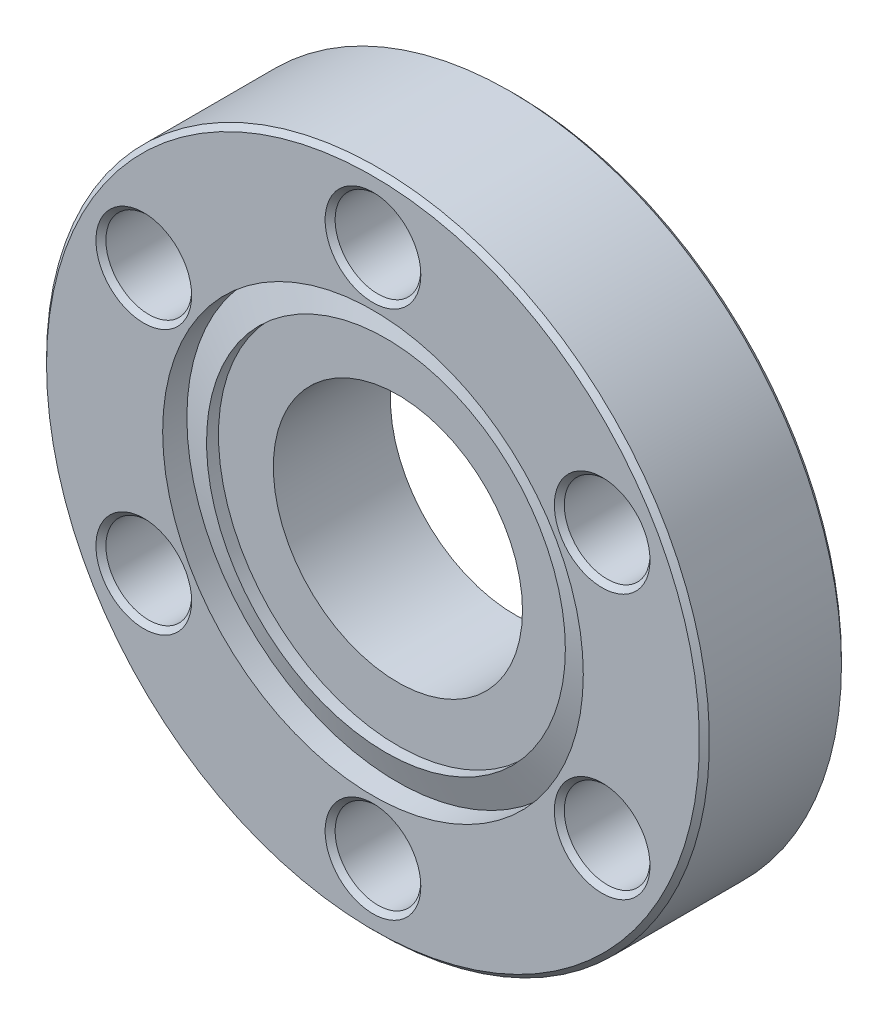
ISO-10303-21;
HEADER;
FILE_DESCRIPTION(('STEP AP214'),'2;1');
FILE_NAME('part.step','',(''),(''),'','','');
FILE_SCHEMA(('AUTOMOTIVE_DESIGN { 1 0 10303 214 1 1 1 1 }'));
ENDSEC;
DATA;
#1=APPLICATION_CONTEXT('core data for automotive mechanical design processes');
#2=APPLICATION_PROTOCOL_DEFINITION('international standard','automotive_design',2000,#1);
#3=PRODUCT_CONTEXT('',#1,'mechanical');
#4=PRODUCT('Part','Part','',(#3));
#5=PRODUCT_RELATED_PRODUCT_CATEGORY('part','',(#4));
#6=PRODUCT_DEFINITION_FORMATION('','',#4);
#7=PRODUCT_DEFINITION_CONTEXT('part definition',#1,'design');
#8=PRODUCT_DEFINITION('design','',#6,#7);
#9=PRODUCT_DEFINITION_SHAPE('','',#8);
#10=(LENGTH_UNIT() NAMED_UNIT(*) SI_UNIT(.MILLI.,.METRE.));
#11=(NAMED_UNIT(*) PLANE_ANGLE_UNIT() SI_UNIT($,.RADIAN.));
#12=(NAMED_UNIT(*) SI_UNIT($,.STERADIAN.) SOLID_ANGLE_UNIT());
#13=UNCERTAINTY_MEASURE_WITH_UNIT(LENGTH_MEASURE(1.E-05),#10,'distance_accuracy_value','');
#14=(GEOMETRIC_REPRESENTATION_CONTEXT(3) GLOBAL_UNCERTAINTY_ASSIGNED_CONTEXT((#13)) GLOBAL_UNIT_ASSIGNED_CONTEXT((#10,
#11,#12)) REPRESENTATION_CONTEXT('',''));
#15=CARTESIAN_POINT('',(0.,0.,0.));
#16=DIRECTION('',(0.,0.,1.));
#17=DIRECTION('',(1.,0.,0.));
#18=AXIS2_PLACEMENT_3D('',#15,#16,#17);
#19=CARTESIAN_POINT('',(0.,0.,-1.27));
#20=DIRECTION('',(0.,0.,1.));
#21=DIRECTION('',(1.,0.,0.));
#22=AXIS2_PLACEMENT_3D('',#19,#20,#21);
#23=PLANE('',#22);
#24=CARTESIAN_POINT('',(0.,0.,-1.27));
#25=DIRECTION('',(0.,0.,1.));
#26=DIRECTION('',(1.,0.,0.));
#27=AXIS2_PLACEMENT_3D('',#24,#25,#26);
#28=CIRCLE('',#27,6.35);
#29=CARTESIAN_POINT('',(6.35,0.,-1.27));
#30=VERTEX_POINT('',#29);
#31=EDGE_CURVE('E134',#30,#30,#28,.T.);
#32=ORIENTED_EDGE('',*,*,#31,.F.);
#33=EDGE_LOOP('',(#32));
#34=FACE_BOUND('',#33,.T.);
#35=CARTESIAN_POINT('',(0.,0.,-1.27));
#36=DIRECTION('',(0.,0.,1.));
#37=DIRECTION('',(1.,0.,0.));
#38=AXIS2_PLACEMENT_3D('',#35,#36,#37);
#39=CIRCLE('',#38,9.144);
#40=CARTESIAN_POINT('',(9.144,0.,-1.27));
#41=VERTEX_POINT('',#40);
#42=EDGE_CURVE('E33',#41,#41,#39,.T.);
#43=ORIENTED_EDGE('',*,*,#42,.T.);
#44=EDGE_LOOP('',(#43));
#45=FACE_BOUND('',#44,.T.);
#46=ADVANCED_FACE('F30',(#34,#45),#23,.T.);
#47=CARTESIAN_POINT('',(0.,0.,-1.3335));
#48=DIRECTION('',(0.,0.,1.));
#49=DIRECTION('',(1.,0.,0.));
#50=AXIS2_PLACEMENT_3D('',#47,#48,#49);
#51=CYLINDRICAL_SURFACE('',#50,9.144);
#52=CARTESIAN_POINT('',(0.,0.,-0.660399999999767));
#53=DIRECTION('',(0.,0.,-1.));
#54=DIRECTION('',(0.,-1.,0.));
#55=AXIS2_PLACEMENT_3D('',#52,#53,#54);
#56=CIRCLE('',#55,9.14400000000008);
#57=CARTESIAN_POINT('',(0.,-9.14400000000008,-0.660399999999767));
#58=VERTEX_POINT('',#57);
#59=EDGE_CURVE('E45',#58,#58,#56,.T.);
#60=ORIENTED_EDGE('',*,*,#59,.F.);
#61=EDGE_LOOP('',(#60));
#62=FACE_BOUND('',#61,.T.);
#63=ORIENTED_EDGE('',*,*,#42,.F.);
#64=EDGE_LOOP('',(#63));
#65=FACE_BOUND('',#64,.T.);
#66=ADVANCED_FACE('F145',(#62,#65),#51,.F.);
#67=CARTESIAN_POINT('',(0.,0.,-1.23358032492253));
#68=DIRECTION('',(0.,0.,-1.));
#69=DIRECTION('',(-1.,0.,0.));
#70=AXIS2_PLACEMENT_3D('',#67,#68,#69);
#71=CONICAL_SURFACE('',#70,10.7187999999999,1.2217304763958);
#72=CARTESIAN_POINT('',(0.,0.,-1.2335803249223));
#73=DIRECTION('',(0.,0.,1.));
#74=DIRECTION('',(1.,0.,0.));
#75=AXIS2_PLACEMENT_3D('',#72,#73,#74);
#76=CIRCLE('',#75,10.7188);
#77=CARTESIAN_POINT('',(10.7188,0.,-1.2335803249223));
#78=VERTEX_POINT('',#77);
#79=EDGE_CURVE('E86',#78,#78,#76,.T.);
#80=ORIENTED_EDGE('',*,*,#79,.T.);
#81=EDGE_LOOP('',(#80));
#82=FACE_BOUND('',#81,.T.);
#83=ORIENTED_EDGE('',*,*,#59,.T.);
#84=EDGE_LOOP('',(#83));
#85=FACE_BOUND('',#84,.T.);
#86=ADVANCED_FACE('F147',(#82,#85),#71,.T.);
#87=CARTESIAN_POINT('',(0.,0.,-1.3335));
#88=DIRECTION('',(0.,0.,1.));
#89=DIRECTION('',(1.,0.,0.));
#90=AXIS2_PLACEMENT_3D('',#87,#88,#89);
#91=CYLINDRICAL_SURFACE('',#90,10.7188);
#92=ORIENTED_EDGE('',*,*,#79,.F.);
#93=EDGE_LOOP('',(#92));
#94=FACE_BOUND('',#93,.T.);
#95=CARTESIAN_POINT('',(0.,0.,0.));
#96=DIRECTION('',(0.,0.,1.));
#97=DIRECTION('',(1.,0.,0.));
#98=AXIS2_PLACEMENT_3D('',#95,#96,#97);
#99=CIRCLE('',#98,10.7188);
#100=CARTESIAN_POINT('',(10.7188,0.,0.));
#101=VERTEX_POINT('',#100);
#102=EDGE_CURVE('E84',#101,#101,#99,.T.);
#103=ORIENTED_EDGE('',*,*,#102,.T.);
#104=EDGE_LOOP('',(#103));
#105=FACE_BOUND('',#104,.T.);
#106=ADVANCED_FACE('F153',(#94,#105),#91,.F.);
#107=CARTESIAN_POINT('',(0.,0.,0.));
#108=DIRECTION('',(0.,0.,-1.));
#109=DIRECTION('',(-1.,0.,0.));
#110=AXIS2_PLACEMENT_3D('',#107,#108,#109);
#111=PLANE('',#110);
#112=CARTESIAN_POINT('',(-11.6804310310013,6.7437,5.6843418860808E-11));
#113=DIRECTION('',(0.,0.,1.));
#114=DIRECTION('',(1.,0.,0.));
#115=AXIS2_PLACEMENT_3D('',#112,#113,#114);
#116=CIRCLE('',#115,2.43840000009326);
#117=CARTESIAN_POINT('',(-9.24203103090804,6.7437,5.6843418860808E-11));
#118=VERTEX_POINT('',#117);
#119=EDGE_CURVE('E63',#118,#118,#116,.F.);
#120=ORIENTED_EDGE('',*,*,#119,.T.);
#121=EDGE_LOOP('',(#120));
#122=FACE_BOUND('',#121,.T.);
#123=CARTESIAN_POINT('',(-11.6804310310013,-6.7437,5.6843418860808E-11));
#124=DIRECTION('',(0.,0.,1.));
#125=DIRECTION('',(1.,0.,0.));
#126=AXIS2_PLACEMENT_3D('',#123,#124,#125);
#127=CIRCLE('',#126,2.43840000009326);
#128=CARTESIAN_POINT('',(-9.24203103090804,-6.7437,5.6843418860808E-11));
#129=VERTEX_POINT('',#128);
#130=EDGE_CURVE('E67',#129,#129,#127,.F.);
#131=ORIENTED_EDGE('',*,*,#130,.T.);
#132=EDGE_LOOP('',(#131));
#133=FACE_BOUND('',#132,.T.);
#134=CARTESIAN_POINT('',(0.,-13.4874,5.6843418860808E-11));
#135=DIRECTION('',(0.,0.,1.));
#136=DIRECTION('',(1.,0.,0.));
#137=AXIS2_PLACEMENT_3D('',#134,#135,#136);
#138=CIRCLE('',#137,2.43840000001683);
#139=CARTESIAN_POINT('',(2.43840000001683,-13.4874,5.6843418860808E-11));
#140=VERTEX_POINT('',#139);
#141=EDGE_CURVE('E70',#140,#140,#138,.F.);
#142=ORIENTED_EDGE('',*,*,#141,.T.);
#143=EDGE_LOOP('',(#142));
#144=FACE_BOUND('',#143,.T.);
#145=CARTESIAN_POINT('',(11.6804310310013,-6.7437,5.6843418860808E-11));
#146=DIRECTION('',(0.,0.,1.));
#147=DIRECTION('',(1.,0.,0.));
#148=AXIS2_PLACEMENT_3D('',#145,#146,#147);
#149=CIRCLE('',#148,2.43839999999724);
#150=CARTESIAN_POINT('',(14.1188310309985,-6.7437,5.6843418860808E-11));
#151=VERTEX_POINT('',#150);
#152=EDGE_CURVE('E73',#151,#151,#149,.F.);
#153=ORIENTED_EDGE('',*,*,#152,.T.);
#154=EDGE_LOOP('',(#153));
#155=FACE_BOUND('',#154,.T.);
#156=CARTESIAN_POINT('',(11.6804310310013,6.7437,5.6843418860808E-11));
#157=DIRECTION('',(0.,0.,1.));
#158=DIRECTION('',(1.,0.,0.));
#159=AXIS2_PLACEMENT_3D('',#156,#157,#158);
#160=CIRCLE('',#159,2.43839999999724);
#161=CARTESIAN_POINT('',(14.1188310309985,6.7437,5.6843418860808E-11));
#162=VERTEX_POINT('',#161);
#163=EDGE_CURVE('E76',#162,#162,#160,.F.);
#164=ORIENTED_EDGE('',*,*,#163,.T.);
#165=EDGE_LOOP('',(#164));
#166=FACE_BOUND('',#165,.T.);
#167=CARTESIAN_POINT('',(0.,13.4874,5.6843418860808E-11));
#168=DIRECTION('',(0.,0.,1.));
#169=DIRECTION('',(1.,0.,0.));
#170=AXIS2_PLACEMENT_3D('',#167,#168,#169);
#171=CIRCLE('',#170,2.43840000001683);
#172=CARTESIAN_POINT('',(2.43840000001683,13.4874,5.6843418860808E-11));
#173=VERTEX_POINT('',#172);
#174=EDGE_CURVE('E79',#173,#173,#171,.F.);
#175=ORIENTED_EDGE('',*,*,#174,.T.);
#176=EDGE_LOOP('',(#175));
#177=FACE_BOUND('',#176,.T.);
#178=ORIENTED_EDGE('',*,*,#102,.F.);
#179=EDGE_LOOP('',(#178));
#180=FACE_BOUND('',#179,.T.);
#181=CARTESIAN_POINT('',(0.,0.,0.));
#182=DIRECTION('',(0.,0.,-1.));
#183=DIRECTION('',(-1.,0.,0.));
#184=AXIS2_PLACEMENT_3D('',#181,#182,#183);
#185=CIRCLE('',#184,16.637);
#186=CARTESIAN_POINT('',(-16.637,0.,0.));
#187=VERTEX_POINT('',#186);
#188=EDGE_CURVE('E82',#187,#187,#185,.T.);
#189=ORIENTED_EDGE('',*,*,#188,.F.);
#190=EDGE_LOOP('',(#189));
#191=FACE_BOUND('',#190,.T.);
#192=ADVANCED_FACE('F250',(#122,#133,#144,#155,#166,#177,#180,#191),#111,.F.);
#193=CARTESIAN_POINT('',(0.,0.,-0.254000000000019));
#194=DIRECTION('',(0.,0.,-1.));
#195=DIRECTION('',(-1.,0.,0.));
#196=AXIS2_PLACEMENT_3D('',#193,#194,#195);
#197=CONICAL_SURFACE('',#196,16.891,0.785398163397301);
#198=CARTESIAN_POINT('',(0.,0.,-0.254));
#199=DIRECTION('',(0.,0.,-1.));
#200=DIRECTION('',(-1.,0.,0.));
#201=AXIS2_PLACEMENT_3D('',#198,#199,#200);
#202=CIRCLE('',#201,16.891);
#203=CARTESIAN_POINT('',(-16.891,0.,-0.254));
#204=VERTEX_POINT('',#203);
#205=EDGE_CURVE('E66',#204,#204,#202,.T.);
#206=ORIENTED_EDGE('',*,*,#205,.F.);
#207=EDGE_LOOP('',(#206));
#208=FACE_BOUND('',#207,.T.);
#209=ORIENTED_EDGE('',*,*,#188,.T.);
#210=EDGE_LOOP('',(#209));
#211=FACE_BOUND('',#210,.T.);
#212=ADVANCED_FACE('F246',(#208,#211),#197,.T.);
#213=CARTESIAN_POINT('',(0.,13.4874,-5.6843418860808E-11));
#214=DIRECTION('',(0.,0.,1.));
#215=DIRECTION('',(1.,0.,0.));
#216=AXIS2_PLACEMENT_3D('',#213,#214,#215);
#217=CONICAL_SURFACE('',#216,2.43839999990314,0.785398163397448);
#218=CARTESIAN_POINT('',(0.,13.4874,-0.254));
#219=DIRECTION('',(0.,0.,-1.));
#220=DIRECTION('',(-1.,0.,0.));
#221=AXIS2_PLACEMENT_3D('',#218,#219,#220);
#222=CIRCLE('',#221,2.1844);
#223=CARTESIAN_POINT('',(-2.1844,13.4874,-0.254));
#224=VERTEX_POINT('',#223);
#225=EDGE_CURVE('E96',#224,#224,#222,.T.);
#226=ORIENTED_EDGE('',*,*,#225,.T.);
#227=EDGE_LOOP('',(#226));
#228=FACE_BOUND('',#227,.T.);
#229=ORIENTED_EDGE('',*,*,#174,.F.);
#230=EDGE_LOOP('',(#229));
#231=FACE_BOUND('',#230,.T.);
#232=ADVANCED_FACE('F242',(#228,#231),#217,.F.);
#233=CARTESIAN_POINT('',(11.6804310310013,6.7437,0.));
#234=DIRECTION('',(0.,0.,1.));
#235=DIRECTION('',(1.,0.,0.));
#236=AXIS2_PLACEMENT_3D('',#233,#234,#235);
#237=CONICAL_SURFACE('',#236,2.43839999994039,0.785398163397448);
#238=CARTESIAN_POINT('',(11.6804310310013,6.7437,-0.254));
#239=DIRECTION('',(0.,0.,-1.));
#240=DIRECTION('',(-1.,0.,0.));
#241=AXIS2_PLACEMENT_3D('',#238,#239,#240);
#242=CIRCLE('',#241,2.1844);
#243=CARTESIAN_POINT('',(9.4960310310013,6.7437,-0.254));
#244=VERTEX_POINT('',#243);
#245=EDGE_CURVE('E99',#244,#244,#242,.T.);
#246=ORIENTED_EDGE('',*,*,#245,.T.);
#247=EDGE_LOOP('',(#246));
#248=FACE_BOUND('',#247,.T.);
#249=ORIENTED_EDGE('',*,*,#163,.F.);
#250=EDGE_LOOP('',(#249));
#251=FACE_BOUND('',#250,.T.);
#252=ADVANCED_FACE('F238',(#248,#251),#237,.F.);
#253=CARTESIAN_POINT('',(11.6804310310013,-6.7437,0.));
#254=DIRECTION('',(0.,0.,1.));
#255=DIRECTION('',(1.,0.,0.));
#256=AXIS2_PLACEMENT_3D('',#253,#254,#255);
#257=CONICAL_SURFACE('',#256,2.43839999994039,0.785398163397448);
#258=CARTESIAN_POINT('',(11.6804310310013,-6.7437,-0.254));
#259=DIRECTION('',(0.,0.,-1.));
#260=DIRECTION('',(-1.,0.,0.));
#261=AXIS2_PLACEMENT_3D('',#258,#259,#260);
#262=CIRCLE('',#261,2.1844);
#263=CARTESIAN_POINT('',(9.4960310310013,-6.7437,-0.254));
#264=VERTEX_POINT('',#263);
#265=EDGE_CURVE('E102',#264,#264,#262,.T.);
#266=ORIENTED_EDGE('',*,*,#265,.T.);
#267=EDGE_LOOP('',(#266));
#268=FACE_BOUND('',#267,.T.);
#269=ORIENTED_EDGE('',*,*,#152,.F.);
#270=EDGE_LOOP('',(#269));
#271=FACE_BOUND('',#270,.T.);
#272=ADVANCED_FACE('F234',(#268,#271),#257,.F.);
#273=CARTESIAN_POINT('',(0.,-13.4874,-5.6843418860808E-11));
#274=DIRECTION('',(0.,0.,1.));
#275=DIRECTION('',(1.,0.,0.));
#276=AXIS2_PLACEMENT_3D('',#273,#274,#275);
#277=CONICAL_SURFACE('',#276,2.43839999990314,0.785398163397448);
#278=CARTESIAN_POINT('',(0.,-13.4874,-0.254));
#279=DIRECTION('',(0.,0.,-1.));
#280=DIRECTION('',(-1.,0.,0.));
#281=AXIS2_PLACEMENT_3D('',#278,#279,#280);
#282=CIRCLE('',#281,2.1844);
#283=CARTESIAN_POINT('',(-2.1844,-13.4874,-0.254));
#284=VERTEX_POINT('',#283);
#285=EDGE_CURVE('E105',#284,#284,#282,.T.);
#286=ORIENTED_EDGE('',*,*,#285,.T.);
#287=EDGE_LOOP('',(#286));
#288=FACE_BOUND('',#287,.T.);
#289=ORIENTED_EDGE('',*,*,#141,.F.);
#290=EDGE_LOOP('',(#289));
#291=FACE_BOUND('',#290,.T.);
#292=ADVANCED_FACE('F230',(#288,#291),#277,.F.);
#293=CARTESIAN_POINT('',(-11.6804310310013,-6.7437,5.6843418860808E-11));
#294=DIRECTION('',(0.,0.,1.));
#295=DIRECTION('',(1.,0.,0.));
#296=AXIS2_PLACEMENT_3D('',#293,#294,#295);
#297=CONICAL_SURFACE('',#296,2.43840000009326,0.785398163397448);
#298=CARTESIAN_POINT('',(-11.6804310310013,-6.7437,-0.254));
#299=DIRECTION('',(0.,0.,-1.));
#300=DIRECTION('',(-1.,0.,0.));
#301=AXIS2_PLACEMENT_3D('',#298,#299,#300);
#302=CIRCLE('',#301,2.1844);
#303=CARTESIAN_POINT('',(-13.8648310310013,-6.7437,-0.254));
#304=VERTEX_POINT('',#303);
#305=EDGE_CURVE('E108',#304,#304,#302,.T.);
#306=ORIENTED_EDGE('',*,*,#305,.T.);
#307=EDGE_LOOP('',(#306));
#308=FACE_BOUND('',#307,.T.);
#309=ORIENTED_EDGE('',*,*,#130,.F.);
#310=EDGE_LOOP('',(#309));
#311=FACE_BOUND('',#310,.T.);
#312=ADVANCED_FACE('F226',(#308,#311),#297,.F.);
#313=CARTESIAN_POINT('',(-11.6804310310013,6.7437,5.6843418860808E-11));
#314=DIRECTION('',(0.,0.,1.));
#315=DIRECTION('',(1.,0.,0.));
#316=AXIS2_PLACEMENT_3D('',#313,#314,#315);
#317=CONICAL_SURFACE('',#316,2.43840000009326,0.785398163397448);
#318=CARTESIAN_POINT('',(-11.6804310310013,6.7437,-0.254));
#319=DIRECTION('',(0.,0.,-1.));
#320=DIRECTION('',(-1.,0.,0.));
#321=AXIS2_PLACEMENT_3D('',#318,#319,#320);
#322=CIRCLE('',#321,2.1844);
#323=CARTESIAN_POINT('',(-13.8648310310013,6.7437,-0.254));
#324=VERTEX_POINT('',#323);
#325=EDGE_CURVE('E111',#324,#324,#322,.T.);
#326=ORIENTED_EDGE('',*,*,#325,.T.);
#327=EDGE_LOOP('',(#326));
#328=FACE_BOUND('',#327,.T.);
#329=ORIENTED_EDGE('',*,*,#119,.F.);
#330=EDGE_LOOP('',(#329));
#331=FACE_BOUND('',#330,.T.);
#332=ADVANCED_FACE('F222',(#328,#331),#317,.F.);
#333=CARTESIAN_POINT('',(0.,0.,0.));
#334=DIRECTION('',(0.,0.,-1.));
#335=DIRECTION('',(-1.,0.,0.));
#336=AXIS2_PLACEMENT_3D('',#333,#334,#335);
#337=CYLINDRICAL_SURFACE('',#336,16.891);
#338=CARTESIAN_POINT('',(0.,0.,-6.98499999999998));
#339=DIRECTION('',(0.,0.,1.));
#340=DIRECTION('',(0.,1.,0.));
#341=AXIS2_PLACEMENT_3D('',#338,#339,#340);
#342=CIRCLE('',#341,16.891);
#343=CARTESIAN_POINT('',(0.,16.891,-6.98499999999998));
#344=VERTEX_POINT('',#343);
#345=EDGE_CURVE('E114',#344,#344,#342,.F.);
#346=ORIENTED_EDGE('',*,*,#345,.F.);
#347=EDGE_LOOP('',(#346));
#348=FACE_BOUND('',#347,.T.);
#349=ORIENTED_EDGE('',*,*,#205,.T.);
#350=EDGE_LOOP('',(#349));
#351=FACE_BOUND('',#350,.T.);
#352=ADVANCED_FACE('F218',(#348,#351),#337,.T.);
#353=CARTESIAN_POINT('',(0.,13.4874,0.));
#354=DIRECTION('',(0.,0.,-1.));
#355=DIRECTION('',(-1.,0.,0.));
#356=AXIS2_PLACEMENT_3D('',#353,#354,#355);
#357=CYLINDRICAL_SURFACE('',#356,2.1844);
#358=CARTESIAN_POINT('',(0.,13.4874,-6.98499999998603));
#359=DIRECTION('',(0.,0.,-1.));
#360=DIRECTION('',(-1.,0.,0.));
#361=AXIS2_PLACEMENT_3D('',#358,#359,#360);
#362=CIRCLE('',#361,2.18439999991915);
#363=CARTESIAN_POINT('',(-2.18439999991915,13.4874,-6.98499999998603));
#364=VERTEX_POINT('',#363);
#365=EDGE_CURVE('E117',#364,#364,#362,.T.);
#366=ORIENTED_EDGE('',*,*,#365,.T.);
#367=EDGE_LOOP('',(#366));
#368=FACE_BOUND('',#367,.T.);
#369=ORIENTED_EDGE('',*,*,#225,.F.);
#370=EDGE_LOOP('',(#369));
#371=FACE_BOUND('',#370,.T.);
#372=ADVANCED_FACE('F214',(#368,#371),#357,.F.);
#373=CARTESIAN_POINT('',(11.6804310310013,6.7437,0.));
#374=DIRECTION('',(0.,0.,-1.));
#375=DIRECTION('',(-1.,0.,0.));
#376=AXIS2_PLACEMENT_3D('',#373,#374,#375);
#377=CYLINDRICAL_SURFACE('',#376,2.1844);
#378=CARTESIAN_POINT('',(11.6804310310013,6.7437,-6.98499999998603));
#379=DIRECTION('',(0.,0.,-1.));
#380=DIRECTION('',(-1.,0.,0.));
#381=AXIS2_PLACEMENT_3D('',#378,#379,#380);
#382=CIRCLE('',#381,2.18439999993874);
#383=CARTESIAN_POINT('',(9.49603103106256,6.7437,-6.98499999998603));
#384=VERTEX_POINT('',#383);
#385=EDGE_CURVE('E120',#384,#384,#382,.T.);
#386=ORIENTED_EDGE('',*,*,#385,.T.);
#387=EDGE_LOOP('',(#386));
#388=FACE_BOUND('',#387,.T.);
#389=ORIENTED_EDGE('',*,*,#245,.F.);
#390=EDGE_LOOP('',(#389));
#391=FACE_BOUND('',#390,.T.);
#392=ADVANCED_FACE('F210',(#388,#391),#377,.F.);
#393=CARTESIAN_POINT('',(11.6804310310013,-6.7437,0.));
#394=DIRECTION('',(0.,0.,-1.));
#395=DIRECTION('',(-1.,0.,0.));
#396=AXIS2_PLACEMENT_3D('',#393,#394,#395);
#397=CYLINDRICAL_SURFACE('',#396,2.1844);
#398=CARTESIAN_POINT('',(11.6804310310013,-6.7437,-6.98499999998603));
#399=DIRECTION('',(0.,0.,-1.));
#400=DIRECTION('',(-1.,0.,0.));
#401=AXIS2_PLACEMENT_3D('',#398,#399,#400);
#402=CIRCLE('',#401,2.18439999993874);
#403=CARTESIAN_POINT('',(9.49603103106256,-6.7437,-6.98499999998603));
#404=VERTEX_POINT('',#403);
#405=EDGE_CURVE('E123',#404,#404,#402,.T.);
#406=ORIENTED_EDGE('',*,*,#405,.T.);
#407=EDGE_LOOP('',(#406));
#408=FACE_BOUND('',#407,.T.);
#409=ORIENTED_EDGE('',*,*,#265,.F.);
#410=EDGE_LOOP('',(#409));
#411=FACE_BOUND('',#410,.T.);
#412=ADVANCED_FACE('F206',(#408,#411),#397,.F.);
#413=CARTESIAN_POINT('',(0.,-13.4874,0.));
#414=DIRECTION('',(0.,0.,-1.));
#415=DIRECTION('',(-1.,0.,0.));
#416=AXIS2_PLACEMENT_3D('',#413,#414,#415);
#417=CYLINDRICAL_SURFACE('',#416,2.1844);
#418=CARTESIAN_POINT('',(0.,-13.4874,-6.98499999998603));
#419=DIRECTION('',(0.,0.,-1.));
#420=DIRECTION('',(-1.,0.,0.));
#421=AXIS2_PLACEMENT_3D('',#418,#419,#420);
#422=CIRCLE('',#421,2.18439999991915);
#423=CARTESIAN_POINT('',(-2.18439999991915,-13.4874,-6.98499999998603));
#424=VERTEX_POINT('',#423);
#425=EDGE_CURVE('E126',#424,#424,#422,.T.);
#426=ORIENTED_EDGE('',*,*,#425,.T.);
#427=EDGE_LOOP('',(#426));
#428=FACE_BOUND('',#427,.T.);
#429=ORIENTED_EDGE('',*,*,#285,.F.);
#430=EDGE_LOOP('',(#429));
#431=FACE_BOUND('',#430,.T.);
#432=ADVANCED_FACE('F202',(#428,#431),#417,.F.);
#433=CARTESIAN_POINT('',(-11.6804310310013,-6.7437,0.));
#434=DIRECTION('',(0.,0.,-1.));
#435=DIRECTION('',(-1.,0.,0.));
#436=AXIS2_PLACEMENT_3D('',#433,#434,#435);
#437=CYLINDRICAL_SURFACE('',#436,2.1844);
#438=CARTESIAN_POINT('',(-11.6804310310013,-6.7437,-6.98500000004287));
#439=DIRECTION('',(0.,0.,-1.));
#440=DIRECTION('',(-1.,0.,0.));
#441=AXIS2_PLACEMENT_3D('',#438,#439,#440);
#442=CIRCLE('',#441,2.1843999999564);
#443=CARTESIAN_POINT('',(-13.8648310309577,-6.7437,-6.98500000004287));
#444=VERTEX_POINT('',#443);
#445=EDGE_CURVE('E129',#444,#444,#442,.T.);
#446=ORIENTED_EDGE('',*,*,#445,.T.);
#447=EDGE_LOOP('',(#446));
#448=FACE_BOUND('',#447,.T.);
#449=ORIENTED_EDGE('',*,*,#305,.F.);
#450=EDGE_LOOP('',(#449));
#451=FACE_BOUND('',#450,.T.);
#452=ADVANCED_FACE('F198',(#448,#451),#437,.F.);
#453=CARTESIAN_POINT('',(-11.6804310310013,6.7437,0.));
#454=DIRECTION('',(0.,0.,-1.));
#455=DIRECTION('',(-1.,0.,0.));
#456=AXIS2_PLACEMENT_3D('',#453,#454,#455);
#457=CYLINDRICAL_SURFACE('',#456,2.1844);
#458=CARTESIAN_POINT('',(-11.6804310310013,6.7437,-6.98500000004287));
#459=DIRECTION('',(0.,0.,-1.));
#460=DIRECTION('',(-1.,0.,0.));
#461=AXIS2_PLACEMENT_3D('',#458,#459,#460);
#462=CIRCLE('',#461,2.1843999999564);
#463=CARTESIAN_POINT('',(-13.8648310309577,6.7437,-6.98500000004287));
#464=VERTEX_POINT('',#463);
#465=EDGE_CURVE('E62',#464,#464,#462,.T.);
#466=ORIENTED_EDGE('',*,*,#465,.T.);
#467=EDGE_LOOP('',(#466));
#468=FACE_BOUND('',#467,.T.);
#469=ORIENTED_EDGE('',*,*,#325,.F.);
#470=EDGE_LOOP('',(#469));
#471=FACE_BOUND('',#470,.T.);
#472=ADVANCED_FACE('F194',(#468,#471),#457,.F.);
#473=CARTESIAN_POINT('',(0.,0.,-6.98499999999998));
#474=DIRECTION('',(0.,0.,1.));
#475=DIRECTION('',(1.,0.,0.));
#476=AXIS2_PLACEMENT_3D('',#473,#474,#475);
#477=CONICAL_SURFACE('',#476,16.891,0.7853981633973);
#478=ORIENTED_EDGE('',*,*,#345,.T.);
#479=EDGE_LOOP('',(#478));
#480=FACE_BOUND('',#479,.T.);
#481=CARTESIAN_POINT('',(0.,0.,-7.23900000000002));
#482=DIRECTION('',(0.,0.,1.));
#483=DIRECTION('',(1.,0.,0.));
#484=AXIS2_PLACEMENT_3D('',#481,#482,#483);
#485=CIRCLE('',#484,16.637);
#486=CARTESIAN_POINT('',(16.637,0.,-7.23900000000002));
#487=VERTEX_POINT('',#486);
#488=EDGE_CURVE('E59',#487,#487,#485,.F.);
#489=ORIENTED_EDGE('',*,*,#488,.F.);
#490=EDGE_LOOP('',(#489));
#491=FACE_BOUND('',#490,.T.);
#492=ADVANCED_FACE('F190',(#480,#491),#477,.T.);
#493=CARTESIAN_POINT('',(0.,13.4874,-7.23899999991318));
#494=DIRECTION('',(0.,0.,-1.));
#495=DIRECTION('',(-1.,0.,0.));
#496=AXIS2_PLACEMENT_3D('',#493,#494,#495);
#497=CONICAL_SURFACE('',#496,2.4383999998463,0.785398163397448);
#498=ORIENTED_EDGE('',*,*,#365,.F.);
#499=EDGE_LOOP('',(#498));
#500=FACE_BOUND('',#499,.T.);
#501=CARTESIAN_POINT('',(0.,13.4874,-7.23899999997002));
#502=DIRECTION('',(0.,0.,-1.));
#503=DIRECTION('',(-1.,0.,0.));
#504=AXIS2_PLACEMENT_3D('',#501,#502,#503);
#505=CIRCLE('',#504,2.43839999990314);
#506=CARTESIAN_POINT('',(-2.43839999990314,13.4874,-7.23899999997002));
#507=VERTEX_POINT('',#506);
#508=EDGE_CURVE('E56',#507,#507,#505,.F.);
#509=ORIENTED_EDGE('',*,*,#508,.F.);
#510=EDGE_LOOP('',(#509));
#511=FACE_BOUND('',#510,.T.);
#512=ADVANCED_FACE('F186',(#500,#511),#497,.F.);
#513=CARTESIAN_POINT('',(11.6804310310013,6.7437,-7.23899999991318));
#514=DIRECTION('',(0.,0.,-1.));
#515=DIRECTION('',(-1.,0.,0.));
#516=AXIS2_PLACEMENT_3D('',#513,#514,#515);
#517=CONICAL_SURFACE('',#516,2.43839999986589,0.785398163397448);
#518=ORIENTED_EDGE('',*,*,#385,.F.);
#519=EDGE_LOOP('',(#518));
#520=FACE_BOUND('',#519,.T.);
#521=CARTESIAN_POINT('',(11.6804310310013,6.7437,-7.23899999997002));
#522=DIRECTION('',(0.,0.,-1.));
#523=DIRECTION('',(-1.,0.,0.));
#524=AXIS2_PLACEMENT_3D('',#521,#522,#523);
#525=CIRCLE('',#524,2.43839999992273);
#526=CARTESIAN_POINT('',(9.24203103107857,6.7437,-7.23899999997002));
#527=VERTEX_POINT('',#526);
#528=EDGE_CURVE('E53',#527,#527,#525,.F.);
#529=ORIENTED_EDGE('',*,*,#528,.F.);
#530=EDGE_LOOP('',(#529));
#531=FACE_BOUND('',#530,.T.);
#532=ADVANCED_FACE('F182',(#520,#531),#517,.F.);
#533=CARTESIAN_POINT('',(11.6804310310013,-6.7437,-7.23899999991318));
#534=DIRECTION('',(0.,0.,-1.));
#535=DIRECTION('',(-1.,0.,0.));
#536=AXIS2_PLACEMENT_3D('',#533,#534,#535);
#537=CONICAL_SURFACE('',#536,2.43839999986589,0.785398163397448);
#538=ORIENTED_EDGE('',*,*,#405,.F.);
#539=EDGE_LOOP('',(#538));
#540=FACE_BOUND('',#539,.T.);
#541=CARTESIAN_POINT('',(11.6804310310013,-6.7437,-7.23899999997002));
#542=DIRECTION('',(0.,0.,-1.));
#543=DIRECTION('',(-1.,0.,0.));
#544=AXIS2_PLACEMENT_3D('',#541,#542,#543);
#545=CIRCLE('',#544,2.43839999992273);
#546=CARTESIAN_POINT('',(9.24203103107857,-6.7437,-7.23899999997002));
#547=VERTEX_POINT('',#546);
#548=EDGE_CURVE('E50',#547,#547,#545,.F.);
#549=ORIENTED_EDGE('',*,*,#548,.F.);
#550=EDGE_LOOP('',(#549));
#551=FACE_BOUND('',#550,.T.);
#552=ADVANCED_FACE('F178',(#540,#551),#537,.F.);
#553=CARTESIAN_POINT('',(0.,-13.4874,-7.23899999991318));
#554=DIRECTION('',(0.,0.,-1.));
#555=DIRECTION('',(-1.,0.,0.));
#556=AXIS2_PLACEMENT_3D('',#553,#554,#555);
#557=CONICAL_SURFACE('',#556,2.4383999998463,0.785398163397448);
#558=ORIENTED_EDGE('',*,*,#425,.F.);
#559=EDGE_LOOP('',(#558));
#560=FACE_BOUND('',#559,.T.);
#561=CARTESIAN_POINT('',(0.,-13.4874,-7.23899999997002));
#562=DIRECTION('',(0.,0.,-1.));
#563=DIRECTION('',(-1.,0.,0.));
#564=AXIS2_PLACEMENT_3D('',#561,#562,#563);
#565=CIRCLE('',#564,2.43839999990314);
#566=CARTESIAN_POINT('',(-2.43839999990314,-13.4874,-7.23899999997002));
#567=VERTEX_POINT('',#566);
#568=EDGE_CURVE('E42',#567,#567,#565,.F.);
#569=ORIENTED_EDGE('',*,*,#568,.F.);
#570=EDGE_LOOP('',(#569));
#571=FACE_BOUND('',#570,.T.);
#572=ADVANCED_FACE('F174',(#560,#571),#557,.F.);
#573=CARTESIAN_POINT('',(-11.6804310310013,-6.7437,-7.23900000002686));
#574=DIRECTION('',(0.,0.,-1.));
#575=DIRECTION('',(0.,1.,0.));
#576=AXIS2_PLACEMENT_3D('',#573,#574,#575);
#577=CONICAL_SURFACE('',#576,2.43839999994039,0.785398163397448);
#578=ORIENTED_EDGE('',*,*,#445,.F.);
#579=EDGE_LOOP('',(#578));
#580=FACE_BOUND('',#579,.T.);
#581=CARTESIAN_POINT('',(-11.6804310310013,-6.7437,-7.23900000008371));
#582=DIRECTION('',(0.,0.,-1.));
#583=DIRECTION('',(0.,1.,0.));
#584=AXIS2_PLACEMENT_3D('',#581,#582,#583);
#585=CIRCLE('',#584,2.43839999999724);
#586=CARTESIAN_POINT('',(-11.6804310310013,-4.30530000000276,-7.23900000008371));
#587=VERTEX_POINT('',#586);
#588=EDGE_CURVE('E37',#587,#587,#585,.F.);
#589=ORIENTED_EDGE('',*,*,#588,.F.);
#590=EDGE_LOOP('',(#589));
#591=FACE_BOUND('',#590,.T.);
#592=ADVANCED_FACE('F168',(#580,#591),#577,.F.);
#593=CARTESIAN_POINT('',(-11.6804310310013,6.7437,-7.23900000002686));
#594=DIRECTION('',(0.,0.,-1.));
#595=DIRECTION('',(0.,1.,0.));
#596=AXIS2_PLACEMENT_3D('',#593,#594,#595);
#597=CONICAL_SURFACE('',#596,2.43839999994039,0.785398163397448);
#598=ORIENTED_EDGE('',*,*,#465,.F.);
#599=EDGE_LOOP('',(#598));
#600=FACE_BOUND('',#599,.T.);
#601=CARTESIAN_POINT('',(-11.6804310310013,6.7437,-7.23900000008371));
#602=DIRECTION('',(0.,0.,-1.));
#603=DIRECTION('',(0.,1.,0.));
#604=AXIS2_PLACEMENT_3D('',#601,#602,#603);
#605=CIRCLE('',#604,2.43839999999724);
#606=CARTESIAN_POINT('',(-11.6804310310013,9.18209999999723,-7.23900000008371));
#607=VERTEX_POINT('',#606);
#608=EDGE_CURVE('E10',#607,#607,#605,.F.);
#609=ORIENTED_EDGE('',*,*,#608,.F.);
#610=EDGE_LOOP('',(#609));
#611=FACE_BOUND('',#610,.T.);
#612=ADVANCED_FACE('F160',(#600,#611),#597,.F.);
#613=CARTESIAN_POINT('',(0.,0.,-7.239));
#614=DIRECTION('',(0.,0.,-1.));
#615=DIRECTION('',(-1.,0.,0.));
#616=AXIS2_PLACEMENT_3D('',#613,#614,#615);
#617=PLANE('',#616);
#618=CARTESIAN_POINT('',(0.,0.,-7.23900000008371));
#619=DIRECTION('',(0.,0.,1.));
#620=DIRECTION('',(1.,0.,0.));
#621=AXIS2_PLACEMENT_3D('',#618,#619,#620);
#622=CIRCLE('',#621,6.35);
#623=CARTESIAN_POINT('',(6.35,0.,-7.23900000008371));
#624=VERTEX_POINT('',#623);
#625=EDGE_CURVE('E137',#624,#624,#622,.T.);
#626=ORIENTED_EDGE('',*,*,#625,.T.);
#627=EDGE_LOOP('',(#626));
#628=FACE_BOUND('',#627,.T.);
#629=ORIENTED_EDGE('',*,*,#608,.T.);
#630=EDGE_LOOP('',(#629));
#631=FACE_BOUND('',#630,.T.);
#632=ORIENTED_EDGE('',*,*,#588,.T.);
#633=EDGE_LOOP('',(#632));
#634=FACE_BOUND('',#633,.T.);
#635=ORIENTED_EDGE('',*,*,#568,.T.);
#636=EDGE_LOOP('',(#635));
#637=FACE_BOUND('',#636,.T.);
#638=ORIENTED_EDGE('',*,*,#548,.T.);
#639=EDGE_LOOP('',(#638));
#640=FACE_BOUND('',#639,.T.);
#641=ORIENTED_EDGE('',*,*,#528,.T.);
#642=EDGE_LOOP('',(#641));
#643=FACE_BOUND('',#642,.T.);
#644=ORIENTED_EDGE('',*,*,#508,.T.);
#645=EDGE_LOOP('',(#644));
#646=FACE_BOUND('',#645,.T.);
#647=ORIENTED_EDGE('',*,*,#488,.T.);
#648=EDGE_LOOP('',(#647));
#649=FACE_BOUND('',#648,.T.);
#650=ADVANCED_FACE('F158',(#628,#631,#634,#637,#640,#643,#646,#649),#617,.T.);
#651=CARTESIAN_POINT('',(0.,0.,-7.23900000008371));
#652=DIRECTION('',(0.,0.,1.));
#653=DIRECTION('',(1.,0.,0.));
#654=AXIS2_PLACEMENT_3D('',#651,#652,#653);
#655=CYLINDRICAL_SURFACE('',#654,6.35);
#656=ORIENTED_EDGE('',*,*,#625,.F.);
#657=EDGE_LOOP('',(#656));
#658=FACE_BOUND('',#657,.T.);
#659=ORIENTED_EDGE('',*,*,#31,.T.);
#660=EDGE_LOOP('',(#659));
#661=FACE_BOUND('',#660,.T.);
#662=ADVANCED_FACE('F156',(#658,#661),#655,.F.);
#663=CLOSED_SHELL('',(#46,#66,#86,#106,#192,#212,#232,#252,#272,#292,#312,#332,#352,#372,#392,
#412,#432,#452,#472,#492,#512,#532,#552,#572,#592,#612,#650,#662));
#664=MANIFOLD_SOLID_BREP('B2',#663);
#665=ADVANCED_BREP_SHAPE_REPRESENTATION('',(#18,#664),#14);
#666=SHAPE_DEFINITION_REPRESENTATION(#9,#665);
ENDSEC;
END-ISO-10303-21;
